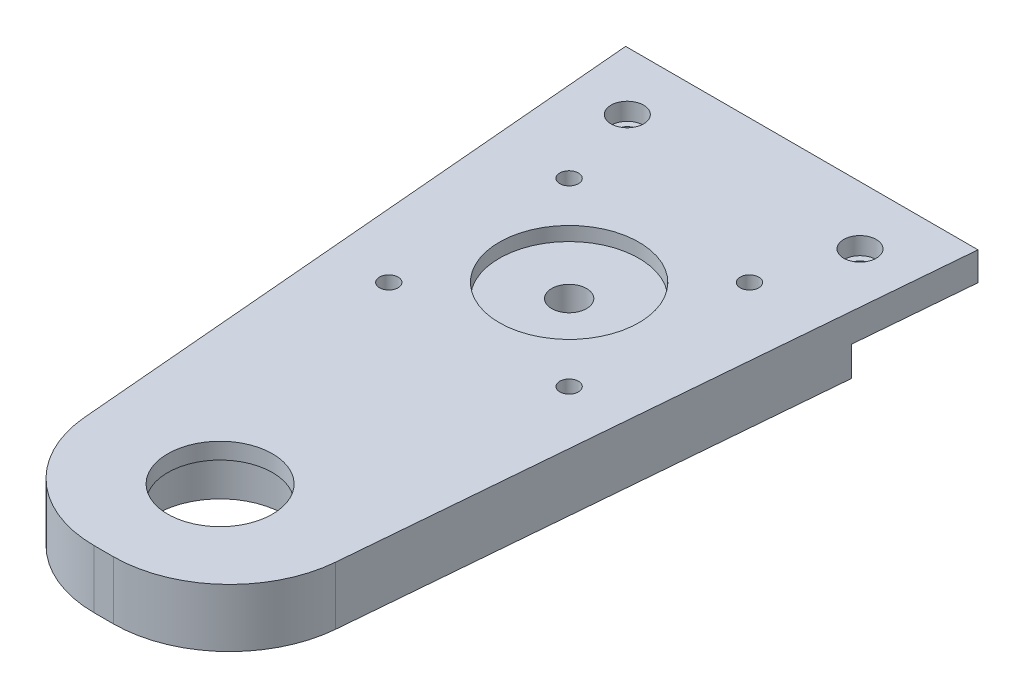
ISO-10303-21;
HEADER;
FILE_DESCRIPTION(('STEP AP214'),'2;1');
FILE_NAME('part.step','',(''),(''),'','','');
FILE_SCHEMA(('AUTOMOTIVE_DESIGN { 1 0 10303 214 1 1 1 1 }'));
ENDSEC;
DATA;
#1=APPLICATION_CONTEXT('core data for automotive mechanical design processes');
#2=APPLICATION_PROTOCOL_DEFINITION('international standard','automotive_design',2000,#1);
#3=PRODUCT_CONTEXT('',#1,'mechanical');
#4=PRODUCT('Part','Part','',(#3));
#5=PRODUCT_RELATED_PRODUCT_CATEGORY('part','',(#4));
#6=PRODUCT_DEFINITION_FORMATION('','',#4);
#7=PRODUCT_DEFINITION_CONTEXT('part definition',#1,'design');
#8=PRODUCT_DEFINITION('design','',#6,#7);
#9=PRODUCT_DEFINITION_SHAPE('','',#8);
#10=(LENGTH_UNIT() NAMED_UNIT(*) SI_UNIT(.MILLI.,.METRE.));
#11=(NAMED_UNIT(*) PLANE_ANGLE_UNIT() SI_UNIT($,.RADIAN.));
#12=(NAMED_UNIT(*) SI_UNIT($,.STERADIAN.) SOLID_ANGLE_UNIT());
#13=UNCERTAINTY_MEASURE_WITH_UNIT(LENGTH_MEASURE(1.E-05),#10,'distance_accuracy_value','');
#14=(GEOMETRIC_REPRESENTATION_CONTEXT(3) GLOBAL_UNCERTAINTY_ASSIGNED_CONTEXT((#13)) GLOBAL_UNIT_ASSIGNED_CONTEXT((#10,
#11,#12)) REPRESENTATION_CONTEXT('',''));
#15=CARTESIAN_POINT('',(0.,0.,0.));
#16=DIRECTION('',(0.,0.,1.));
#17=DIRECTION('',(1.,0.,0.));
#18=AXIS2_PLACEMENT_3D('',#15,#16,#17);
#19=CARTESIAN_POINT('',(-20.,10.2,240.));
#20=DIRECTION('',(0.,-1.,0.));
#21=DIRECTION('',(0.,0.,-1.));
#22=AXIS2_PLACEMENT_3D('',#19,#20,#21);
#23=CYLINDRICAL_SURFACE('',#22,1.69999999999998);
#24=CARTESIAN_POINT('',(-20.,5.1,240.));
#25=DIRECTION('',(0.,-1.,0.));
#26=DIRECTION('',(0.,0.,1.));
#27=AXIS2_PLACEMENT_3D('',#24,#25,#26);
#28=CIRCLE('',#27,1.69999999999998);
#29=CARTESIAN_POINT('',(-20.,5.1,241.7));
#30=VERTEX_POINT('',#29);
#31=EDGE_CURVE('E359',#30,#30,#28,.T.);
#32=ORIENTED_EDGE('',*,*,#31,.T.);
#33=EDGE_LOOP('',(#32));
#34=FACE_BOUND('',#33,.T.);
#35=CARTESIAN_POINT('',(-20.,7.,240.));
#36=DIRECTION('',(0.,1.,0.));
#37=DIRECTION('',(0.,0.,1.));
#38=AXIS2_PLACEMENT_3D('',#35,#36,#37);
#39=CIRCLE('',#38,1.69999999999998);
#40=CARTESIAN_POINT('',(-20.,7.,241.7));
#41=VERTEX_POINT('',#40);
#42=EDGE_CURVE('E183',#41,#41,#39,.F.);
#43=ORIENTED_EDGE('',*,*,#42,.F.);
#44=EDGE_LOOP('',(#43));
#45=FACE_BOUND('',#44,.T.);
#46=ADVANCED_FACE('F39',(#34,#45),#23,.F.);
#47=CARTESIAN_POINT('',(20.,10.2,240.));
#48=DIRECTION('',(0.,-1.,0.));
#49=DIRECTION('',(0.,0.,-1.));
#50=AXIS2_PLACEMENT_3D('',#47,#48,#49);
#51=CYLINDRICAL_SURFACE('',#50,1.7);
#52=CARTESIAN_POINT('',(20.,5.1,240.));
#53=DIRECTION('',(0.,-1.,0.));
#54=DIRECTION('',(0.,0.,-1.));
#55=AXIS2_PLACEMENT_3D('',#52,#53,#54);
#56=CIRCLE('',#55,1.7);
#57=CARTESIAN_POINT('',(20.,5.1,238.3));
#58=VERTEX_POINT('',#57);
#59=EDGE_CURVE('E136',#58,#58,#56,.T.);
#60=ORIENTED_EDGE('',*,*,#59,.T.);
#61=EDGE_LOOP('',(#60));
#62=FACE_BOUND('',#61,.T.);
#63=CARTESIAN_POINT('',(20.,7.,240.));
#64=DIRECTION('',(0.,1.,0.));
#65=DIRECTION('',(0.,0.,1.));
#66=AXIS2_PLACEMENT_3D('',#63,#64,#65);
#67=CIRCLE('',#66,1.7);
#68=CARTESIAN_POINT('',(20.,7.,241.7));
#69=VERTEX_POINT('',#68);
#70=EDGE_CURVE('E180',#69,#69,#67,.F.);
#71=ORIENTED_EDGE('',*,*,#70,.F.);
#72=EDGE_LOOP('',(#71));
#73=FACE_BOUND('',#72,.T.);
#74=ADVANCED_FACE('F231',(#62,#73),#51,.F.);
#75=CARTESIAN_POINT('',(0.,11.,270.));
#76=DIRECTION('',(0.,-1.,0.));
#77=DIRECTION('',(0.,0.,-1.));
#78=AXIS2_PLACEMENT_3D('',#75,#76,#77);
#79=CYLINDRICAL_SURFACE('',#78,3.);
#80=CARTESIAN_POINT('',(0.,0.,270.));
#81=DIRECTION('',(0.,-1.,0.));
#82=DIRECTION('',(0.,0.,-1.));
#83=AXIS2_PLACEMENT_3D('',#80,#81,#82);
#84=CIRCLE('',#83,3.);
#85=CARTESIAN_POINT('',(0.,0.,267.));
#86=VERTEX_POINT('',#85);
#87=EDGE_CURVE('E372',#86,#86,#84,.T.);
#88=ORIENTED_EDGE('',*,*,#87,.T.);
#89=EDGE_LOOP('',(#88));
#90=FACE_BOUND('',#89,.T.);
#91=CARTESIAN_POINT('',(0.,7.6,270.));
#92=DIRECTION('',(0.,1.,0.));
#93=DIRECTION('',(0.,0.,1.));
#94=AXIS2_PLACEMENT_3D('',#91,#92,#93);
#95=CIRCLE('',#94,3.);
#96=CARTESIAN_POINT('',(0.,7.6,273.));
#97=VERTEX_POINT('',#96);
#98=EDGE_CURVE('E175',#97,#97,#95,.F.);
#99=ORIENTED_EDGE('',*,*,#98,.F.);
#100=EDGE_LOOP('',(#99));
#101=FACE_BOUND('',#100,.T.);
#102=ADVANCED_FACE('F238',(#90,#101),#79,.F.);
#103=CARTESIAN_POINT('',(15.5000000000001,-2.,254.5));
#104=DIRECTION('',(0.,1.,0.));
#105=DIRECTION('',(0.,0.,1.));
#106=AXIS2_PLACEMENT_3D('',#103,#104,#105);
#107=CYLINDRICAL_SURFACE('',#106,1.6);
#108=CARTESIAN_POINT('',(15.5000000000001,10.,254.5));
#109=DIRECTION('',(0.,1.,0.));
#110=DIRECTION('',(0.,0.,1.));
#111=AXIS2_PLACEMENT_3D('',#108,#109,#110);
#112=CIRCLE('',#111,1.6);
#113=CARTESIAN_POINT('',(15.5000000000001,10.,256.1));
#114=VERTEX_POINT('',#113);
#115=EDGE_CURVE('E375',#114,#114,#112,.T.);
#116=ORIENTED_EDGE('',*,*,#115,.T.);
#117=EDGE_LOOP('',(#116));
#118=FACE_BOUND('',#117,.T.);
#119=CARTESIAN_POINT('',(15.5000000000001,3.5,254.5));
#120=DIRECTION('',(0.,-1.,0.));
#121=DIRECTION('',(0.,0.,-1.));
#122=AXIS2_PLACEMENT_3D('',#119,#120,#121);
#123=CIRCLE('',#122,1.6);
#124=CARTESIAN_POINT('',(15.5000000000001,3.5,252.9));
#125=VERTEX_POINT('',#124);
#126=EDGE_CURVE('E171',#125,#125,#123,.F.);
#127=ORIENTED_EDGE('',*,*,#126,.F.);
#128=EDGE_LOOP('',(#127));
#129=FACE_BOUND('',#128,.T.);
#130=ADVANCED_FACE('F326',(#118,#129),#107,.F.);
#131=CARTESIAN_POINT('',(-15.5,-2.,254.5));
#132=DIRECTION('',(0.,1.,0.));
#133=DIRECTION('',(0.,0.,1.));
#134=AXIS2_PLACEMENT_3D('',#131,#132,#133);
#135=CYLINDRICAL_SURFACE('',#134,1.6);
#136=CARTESIAN_POINT('',(-15.5,10.,254.5));
#137=DIRECTION('',(0.,1.,0.));
#138=DIRECTION('',(0.,0.,1.));
#139=AXIS2_PLACEMENT_3D('',#136,#137,#138);
#140=CIRCLE('',#139,1.6);
#141=CARTESIAN_POINT('',(-15.5,10.,256.1));
#142=VERTEX_POINT('',#141);
#143=EDGE_CURVE('E378',#142,#142,#140,.T.);
#144=ORIENTED_EDGE('',*,*,#143,.T.);
#145=EDGE_LOOP('',(#144));
#146=FACE_BOUND('',#145,.T.);
#147=CARTESIAN_POINT('',(-15.5,3.5,254.5));
#148=DIRECTION('',(0.,-1.,0.));
#149=DIRECTION('',(0.,0.,-1.));
#150=AXIS2_PLACEMENT_3D('',#147,#148,#149);
#151=CIRCLE('',#150,1.6);
#152=CARTESIAN_POINT('',(-15.5,3.5,252.9));
#153=VERTEX_POINT('',#152);
#154=EDGE_CURVE('E167',#153,#153,#151,.F.);
#155=ORIENTED_EDGE('',*,*,#154,.F.);
#156=EDGE_LOOP('',(#155));
#157=FACE_BOUND('',#156,.T.);
#158=ADVANCED_FACE('F322',(#146,#157),#135,.F.);
#159=CARTESIAN_POINT('',(-15.4999999999997,-2.,285.5));
#160=DIRECTION('',(0.,1.,0.));
#161=DIRECTION('',(0.,0.,1.));
#162=AXIS2_PLACEMENT_3D('',#159,#160,#161);
#163=CYLINDRICAL_SURFACE('',#162,1.6);
#164=CARTESIAN_POINT('',(-15.4999999999997,10.,285.5));
#165=DIRECTION('',(0.,1.,0.));
#166=DIRECTION('',(0.,0.,1.));
#167=AXIS2_PLACEMENT_3D('',#164,#165,#166);
#168=CIRCLE('',#167,1.6);
#169=CARTESIAN_POINT('',(-15.4999999999997,10.,287.1));
#170=VERTEX_POINT('',#169);
#171=EDGE_CURVE('E381',#170,#170,#168,.T.);
#172=ORIENTED_EDGE('',*,*,#171,.T.);
#173=EDGE_LOOP('',(#172));
#174=FACE_BOUND('',#173,.T.);
#175=CARTESIAN_POINT('',(-15.4999999999997,3.5,285.5));
#176=DIRECTION('',(0.,-1.,0.));
#177=DIRECTION('',(0.,0.,-1.));
#178=AXIS2_PLACEMENT_3D('',#175,#176,#177);
#179=CIRCLE('',#178,1.59999999999999);
#180=CARTESIAN_POINT('',(-15.4999999999997,3.5,283.9));
#181=VERTEX_POINT('',#180);
#182=EDGE_CURVE('E389',#181,#181,#179,.T.);
#183=ORIENTED_EDGE('',*,*,#182,.T.);
#184=EDGE_LOOP('',(#183));
#185=FACE_BOUND('',#184,.T.);
#186=ADVANCED_FACE('F325',(#174,#185),#163,.F.);
#187=CARTESIAN_POINT('',(15.5000000000003,-2.,285.5));
#188=DIRECTION('',(0.,1.,0.));
#189=DIRECTION('',(0.,0.,1.));
#190=AXIS2_PLACEMENT_3D('',#187,#188,#189);
#191=CYLINDRICAL_SURFACE('',#190,1.6);
#192=CARTESIAN_POINT('',(15.5000000000003,10.,285.5));
#193=DIRECTION('',(0.,1.,0.));
#194=DIRECTION('',(0.,0.,1.));
#195=AXIS2_PLACEMENT_3D('',#192,#193,#194);
#196=CIRCLE('',#195,1.6);
#197=CARTESIAN_POINT('',(15.5000000000003,10.,287.1));
#198=VERTEX_POINT('',#197);
#199=EDGE_CURVE('E174',#198,#198,#196,.T.);
#200=ORIENTED_EDGE('',*,*,#199,.T.);
#201=EDGE_LOOP('',(#200));
#202=FACE_BOUND('',#201,.T.);
#203=CARTESIAN_POINT('',(15.5000000000003,3.5,285.5));
#204=DIRECTION('',(0.,-1.,0.));
#205=DIRECTION('',(0.,0.,-1.));
#206=AXIS2_PLACEMENT_3D('',#203,#204,#205);
#207=CIRCLE('',#206,1.6);
#208=CARTESIAN_POINT('',(15.5000000000003,3.5,283.9));
#209=VERTEX_POINT('',#208);
#210=EDGE_CURVE('E164',#209,#209,#207,.F.);
#211=ORIENTED_EDGE('',*,*,#210,.F.);
#212=EDGE_LOOP('',(#211));
#213=FACE_BOUND('',#212,.T.);
#214=ADVANCED_FACE('F330',(#202,#213),#191,.F.);
#215=CARTESIAN_POINT('',(0.,0.,0.));
#216=DIRECTION('',(0.,-1.,0.));
#217=DIRECTION('',(0.,0.,-1.));
#218=AXIS2_PLACEMENT_3D('',#215,#216,#217);
#219=PLANE('',#218);
#220=CARTESIAN_POINT('',(-15.4999999999996,0.,254.5));
#221=DIRECTION('',(0.,-1.,0.));
#222=DIRECTION('',(0.,0.,-1.));
#223=AXIS2_PLACEMENT_3D('',#220,#221,#222);
#224=CIRCLE('',#223,2.89999999999996);
#225=CARTESIAN_POINT('',(-15.4999999999996,0.,251.6));
#226=VERTEX_POINT('',#225);
#227=EDGE_CURVE('E397',#226,#226,#224,.T.);
#228=ORIENTED_EDGE('',*,*,#227,.F.);
#229=EDGE_LOOP('',(#228));
#230=FACE_BOUND('',#229,.T.);
#231=CARTESIAN_POINT('',(15.5000000000001,0.,254.5));
#232=DIRECTION('',(0.,-1.,0.));
#233=DIRECTION('',(0.,0.,-1.));
#234=AXIS2_PLACEMENT_3D('',#231,#232,#233);
#235=CIRCLE('',#234,2.89999999999999);
#236=CARTESIAN_POINT('',(15.5000000000001,0.,251.6));
#237=VERTEX_POINT('',#236);
#238=EDGE_CURVE('E403',#237,#237,#235,.T.);
#239=ORIENTED_EDGE('',*,*,#238,.F.);
#240=EDGE_LOOP('',(#239));
#241=FACE_BOUND('',#240,.T.);
#242=CARTESIAN_POINT('',(15.4999999999999,0.,285.5));
#243=DIRECTION('',(0.,-1.,0.));
#244=DIRECTION('',(0.,0.,-1.));
#245=AXIS2_PLACEMENT_3D('',#242,#243,#244);
#246=CIRCLE('',#245,2.90000000000001);
#247=CARTESIAN_POINT('',(15.4999999999999,0.,282.6));
#248=VERTEX_POINT('',#247);
#249=EDGE_CURVE('E394',#248,#248,#246,.T.);
#250=ORIENTED_EDGE('',*,*,#249,.F.);
#251=EDGE_LOOP('',(#250));
#252=FACE_BOUND('',#251,.T.);
#253=CARTESIAN_POINT('',(-15.4999999999997,0.,285.5));
#254=DIRECTION('',(0.,-1.,0.));
#255=DIRECTION('',(0.,0.,-1.));
#256=AXIS2_PLACEMENT_3D('',#253,#254,#255);
#257=CIRCLE('',#256,2.89999999999999);
#258=CARTESIAN_POINT('',(-15.4999999999997,0.,282.6));
#259=VERTEX_POINT('',#258);
#260=EDGE_CURVE('E386',#259,#259,#257,.T.);
#261=ORIENTED_EDGE('',*,*,#260,.F.);
#262=EDGE_LOOP('',(#261));
#263=FACE_BOUND('',#262,.T.);
#264=ORIENTED_EDGE('',*,*,#87,.F.);
#265=EDGE_LOOP('',(#264));
#266=FACE_BOUND('',#265,.T.);
#267=CARTESIAN_POINT('',(0.,0.,330.));
#268=DIRECTION('',(0.,-1.,0.));
#269=DIRECTION('',(0.,0.,-1.));
#270=AXIS2_PLACEMENT_3D('',#267,#268,#269);
#271=CIRCLE('',#270,11.);
#272=CARTESIAN_POINT('',(0.,0.,319.));
#273=VERTEX_POINT('',#272);
#274=EDGE_CURVE('E162',#273,#273,#271,.T.);
#275=ORIENTED_EDGE('',*,*,#274,.F.);
#276=EDGE_LOOP('',(#275));
#277=FACE_BOUND('',#276,.T.);
#278=DIRECTION('',(1.,0.,0.));
#279=VECTOR('',#278,1.);
#280=CARTESIAN_POINT('',(0.,0.,350.));
#281=LINE('',#280,#279);
#282=CARTESIAN_POINT('',(-1.64095077685681,0.,350.));
#283=VERTEX_POINT('',#282);
#284=CARTESIAN_POINT('',(1.64095077685684,0.,350.));
#285=VERTEX_POINT('',#284);
#286=EDGE_CURVE('E146',#283,#285,#281,.T.);
#287=ORIENTED_EDGE('',*,*,#286,.F.);
#288=CARTESIAN_POINT('',(-1.64095077685681,0.,330.));
#289=DIRECTION('',(0.,-1.,0.));
#290=DIRECTION('',(0.,0.,-1.));
#291=AXIS2_PLACEMENT_3D('',#288,#289,#290);
#292=CIRCLE('',#291,20.);
#293=CARTESIAN_POINT('',(-21.5678837576918,0.,331.708022826929));
#294=VERTEX_POINT('',#293);
#295=EDGE_CURVE('E194',#283,#294,#292,.T.);
#296=ORIENTED_EDGE('',*,*,#295,.T.);
#297=DIRECTION('',(0.0854011413464358,0.,0.996346649041751));
#298=VECTOR('',#297,1.);
#299=CARTESIAN_POINT('',(-49.6353322528363,0.,4.25445705024311));
#300=LINE('',#299,#298);
#301=CARTESIAN_POINT('',(-28.5714285714286,0.,250.));
#302=VERTEX_POINT('',#301);
#303=EDGE_CURVE('E147',#302,#294,#300,.T.);
#304=ORIENTED_EDGE('',*,*,#303,.F.);
#305=DIRECTION('',(1.,0.,0.));
#306=VECTOR('',#305,1.);
#307=CARTESIAN_POINT('',(0.,0.,250.));
#308=LINE('',#307,#306);
#309=CARTESIAN_POINT('',(28.5714285714286,0.,250.));
#310=VERTEX_POINT('',#309);
#311=EDGE_CURVE('E113',#302,#310,#308,.T.);
#312=ORIENTED_EDGE('',*,*,#311,.T.);
#313=DIRECTION('',(-0.0854011413464357,0.,0.996346649041751));
#314=VECTOR('',#313,1.);
#315=CARTESIAN_POINT('',(49.6353322528363,0.,4.25445705024311));
#316=LINE('',#315,#314);
#317=CARTESIAN_POINT('',(21.5678837576919,0.,331.708022826929));
#318=VERTEX_POINT('',#317);
#319=EDGE_CURVE('E143',#310,#318,#316,.T.);
#320=ORIENTED_EDGE('',*,*,#319,.T.);
#321=CARTESIAN_POINT('',(1.64095077685684,0.,330.));
#322=DIRECTION('',(0.,-1.,0.));
#323=DIRECTION('',(0.,0.,-1.));
#324=AXIS2_PLACEMENT_3D('',#321,#322,#323);
#325=CIRCLE('',#324,20.);
#326=EDGE_CURVE('E192',#318,#285,#325,.T.);
#327=ORIENTED_EDGE('',*,*,#326,.T.);
#328=EDGE_LOOP('',(#287,#296,#304,#312,#320,#327));
#329=FACE_BOUND('',#328,.T.);
#330=ADVANCED_FACE('F209',(#230,#241,#252,#263,#266,#277,#329),#219,.T.);
#331=CARTESIAN_POINT('',(49.6353322528363,10.,4.25445705024311));
#332=DIRECTION('',(0.996346649041751,0.,0.0854011413464357));
#333=DIRECTION('',(0.0854011413464357,0.,-0.996346649041751));
#334=AXIS2_PLACEMENT_3D('',#331,#332,#333);
#335=PLANE('',#334);
#336=DIRECTION('',(-0.0854011413464357,0.,0.996346649041751));
#337=VECTOR('',#336,1.);
#338=CARTESIAN_POINT('',(49.6353322528363,10.,4.25445705024311));
#339=LINE('',#338,#337);
#340=CARTESIAN_POINT('',(30.2857142857143,10.,230.));
#341=VERTEX_POINT('',#340);
#342=CARTESIAN_POINT('',(21.5678837576919,10.,331.708022826929));
#343=VERTEX_POINT('',#342);
#344=EDGE_CURVE('E149',#341,#343,#339,.T.);
#345=ORIENTED_EDGE('',*,*,#344,.T.);
#346=DIRECTION('',(0.,-1.,0.));
#347=VECTOR('',#346,1.);
#348=CARTESIAN_POINT('',(21.5678837576919,0.,331.708022826929));
#349=LINE('',#348,#347);
#350=EDGE_CURVE('E11',#343,#318,#349,.T.);
#351=ORIENTED_EDGE('',*,*,#350,.T.);
#352=ORIENTED_EDGE('',*,*,#319,.F.);
#353=DIRECTION('',(0.,-1.,0.));
#354=VECTOR('',#353,1.);
#355=CARTESIAN_POINT('',(28.5714285714286,5.1,250.));
#356=LINE('',#355,#354);
#357=CARTESIAN_POINT('',(28.5714285714286,5.1,250.));
#358=VERTEX_POINT('',#357);
#359=EDGE_CURVE('E116',#358,#310,#356,.T.);
#360=ORIENTED_EDGE('',*,*,#359,.F.);
#361=DIRECTION('',(-0.0854011413464357,0.,0.996346649041751));
#362=VECTOR('',#361,1.);
#363=CARTESIAN_POINT('',(49.6353322528363,5.1,4.25445705024311));
#364=LINE('',#363,#362);
#365=CARTESIAN_POINT('',(30.2857142857143,5.1,230.));
#366=VERTEX_POINT('',#365);
#367=EDGE_CURVE('E117',#366,#358,#364,.T.);
#368=ORIENTED_EDGE('',*,*,#367,.F.);
#369=DIRECTION('',(0.,1.,0.));
#370=VECTOR('',#369,1.);
#371=CARTESIAN_POINT('',(30.2857142857143,10.,230.));
#372=LINE('',#371,#370);
#373=EDGE_CURVE('E141',#366,#341,#372,.T.);
#374=ORIENTED_EDGE('',*,*,#373,.T.);
#375=EDGE_LOOP('',(#345,#351,#352,#360,#368,#374));
#376=FACE_BOUND('',#375,.T.);
#377=ADVANCED_FACE('F214',(#376),#335,.T.);
#378=CARTESIAN_POINT('',(-49.6353322528363,10.,4.25445705024311));
#379=DIRECTION('',(0.996346649041751,0.,-0.0854011413464358));
#380=DIRECTION('',(-0.0854011413464358,0.,-0.996346649041751));
#381=AXIS2_PLACEMENT_3D('',#378,#379,#380);
#382=PLANE('',#381);
#383=ORIENTED_EDGE('',*,*,#303,.T.);
#384=DIRECTION('',(0.,-1.,0.));
#385=VECTOR('',#384,1.);
#386=CARTESIAN_POINT('',(-21.5678837576918,10.,331.708022826929));
#387=LINE('',#386,#385);
#388=CARTESIAN_POINT('',(-21.5678837576918,10.,331.708022826929));
#389=VERTEX_POINT('',#388);
#390=EDGE_CURVE('E62',#294,#389,#387,.F.);
#391=ORIENTED_EDGE('',*,*,#390,.T.);
#392=DIRECTION('',(0.0854011413464358,0.,0.996346649041751));
#393=VECTOR('',#392,1.);
#394=CARTESIAN_POINT('',(-49.6353322528363,10.,4.25445705024311));
#395=LINE('',#394,#393);
#396=CARTESIAN_POINT('',(-30.2857142857143,10.,230.));
#397=VERTEX_POINT('',#396);
#398=EDGE_CURVE('E144',#397,#389,#395,.T.);
#399=ORIENTED_EDGE('',*,*,#398,.F.);
#400=DIRECTION('',(0.,1.,0.));
#401=VECTOR('',#400,1.);
#402=CARTESIAN_POINT('',(-30.2857142857143,10.,230.));
#403=LINE('',#402,#401);
#404=CARTESIAN_POINT('',(-30.2857142857143,5.1,230.));
#405=VERTEX_POINT('',#404);
#406=EDGE_CURVE('E128',#405,#397,#403,.T.);
#407=ORIENTED_EDGE('',*,*,#406,.F.);
#408=DIRECTION('',(-0.0854011413464358,0.,-0.996346649041751));
#409=VECTOR('',#408,1.);
#410=CARTESIAN_POINT('',(-49.6353322528363,5.1,4.25445705024311));
#411=LINE('',#410,#409);
#412=CARTESIAN_POINT('',(-28.5714285714286,5.1,250.));
#413=VERTEX_POINT('',#412);
#414=EDGE_CURVE('E121',#413,#405,#411,.T.);
#415=ORIENTED_EDGE('',*,*,#414,.F.);
#416=DIRECTION('',(0.,-1.,0.));
#417=VECTOR('',#416,1.);
#418=CARTESIAN_POINT('',(-28.5714285714286,5.1,250.));
#419=LINE('',#418,#417);
#420=EDGE_CURVE('E107',#413,#302,#419,.T.);
#421=ORIENTED_EDGE('',*,*,#420,.T.);
#422=EDGE_LOOP('',(#383,#391,#399,#407,#415,#421));
#423=FACE_BOUND('',#422,.T.);
#424=ADVANCED_FACE('F127',(#423),#382,.F.);
#425=CARTESIAN_POINT('',(0.,10.,230.));
#426=DIRECTION('',(0.,0.,-1.));
#427=DIRECTION('',(-1.,0.,0.));
#428=AXIS2_PLACEMENT_3D('',#425,#426,#427);
#429=PLANE('',#428);
#430=ORIENTED_EDGE('',*,*,#373,.F.);
#431=DIRECTION('',(1.,0.,0.));
#432=VECTOR('',#431,1.);
#433=CARTESIAN_POINT('',(0.,5.1,230.));
#434=LINE('',#433,#432);
#435=EDGE_CURVE('E129',#405,#366,#434,.T.);
#436=ORIENTED_EDGE('',*,*,#435,.F.);
#437=ORIENTED_EDGE('',*,*,#406,.T.);
#438=DIRECTION('',(1.,0.,0.));
#439=VECTOR('',#438,1.);
#440=CARTESIAN_POINT('',(0.,10.,230.));
#441=LINE('',#440,#439);
#442=EDGE_CURVE('E137',#397,#341,#441,.T.);
#443=ORIENTED_EDGE('',*,*,#442,.T.);
#444=EDGE_LOOP('',(#430,#436,#437,#443));
#445=FACE_BOUND('',#444,.T.);
#446=ADVANCED_FACE('F217',(#445),#429,.T.);
#447=CARTESIAN_POINT('',(0.,10.,0.));
#448=DIRECTION('',(0.,-1.,0.));
#449=DIRECTION('',(0.,0.,-1.));
#450=AXIS2_PLACEMENT_3D('',#447,#448,#449);
#451=PLANE('',#450);
#452=CARTESIAN_POINT('',(-20.,10.,240.));
#453=DIRECTION('',(0.,1.,0.));
#454=DIRECTION('',(0.,0.,1.));
#455=AXIS2_PLACEMENT_3D('',#452,#453,#454);
#456=CIRCLE('',#455,2.8);
#457=CARTESIAN_POINT('',(-20.,10.,242.8));
#458=VERTEX_POINT('',#457);
#459=EDGE_CURVE('E421',#458,#458,#456,.T.);
#460=ORIENTED_EDGE('',*,*,#459,.F.);
#461=EDGE_LOOP('',(#460));
#462=FACE_BOUND('',#461,.T.);
#463=CARTESIAN_POINT('',(20.,10.,240.));
#464=DIRECTION('',(0.,1.,0.));
#465=DIRECTION('',(0.,0.,1.));
#466=AXIS2_PLACEMENT_3D('',#463,#464,#465);
#467=CIRCLE('',#466,2.8);
#468=CARTESIAN_POINT('',(20.,10.,242.8));
#469=VERTEX_POINT('',#468);
#470=EDGE_CURVE('E418',#469,#469,#467,.T.);
#471=ORIENTED_EDGE('',*,*,#470,.F.);
#472=EDGE_LOOP('',(#471));
#473=FACE_BOUND('',#472,.T.);
#474=CARTESIAN_POINT('',(0.,10.,270.));
#475=DIRECTION('',(0.,1.,0.));
#476=DIRECTION('',(0.,0.,1.));
#477=AXIS2_PLACEMENT_3D('',#474,#475,#476);
#478=CIRCLE('',#477,12.);
#479=CARTESIAN_POINT('',(0.,10.,282.));
#480=VERTEX_POINT('',#479);
#481=EDGE_CURVE('E187',#480,#480,#478,.T.);
#482=ORIENTED_EDGE('',*,*,#481,.F.);
#483=EDGE_LOOP('',(#482));
#484=FACE_BOUND('',#483,.T.);
#485=ORIENTED_EDGE('',*,*,#199,.F.);
#486=EDGE_LOOP('',(#485));
#487=FACE_BOUND('',#486,.T.);
#488=ORIENTED_EDGE('',*,*,#171,.F.);
#489=EDGE_LOOP('',(#488));
#490=FACE_BOUND('',#489,.T.);
#491=ORIENTED_EDGE('',*,*,#143,.F.);
#492=EDGE_LOOP('',(#491));
#493=FACE_BOUND('',#492,.T.);
#494=ORIENTED_EDGE('',*,*,#115,.F.);
#495=EDGE_LOOP('',(#494));
#496=FACE_BOUND('',#495,.T.);
#497=CARTESIAN_POINT('',(0.,10.,330.));
#498=DIRECTION('',(0.,-1.,0.));
#499=DIRECTION('',(0.,0.,-1.));
#500=AXIS2_PLACEMENT_3D('',#497,#498,#499);
#501=CIRCLE('',#500,9.);
#502=CARTESIAN_POINT('',(0.,10.,321.));
#503=VERTEX_POINT('',#502);
#504=EDGE_CURVE('E159',#503,#503,#501,.T.);
#505=ORIENTED_EDGE('',*,*,#504,.T.);
#506=EDGE_LOOP('',(#505));
#507=FACE_BOUND('',#506,.T.);
#508=ORIENTED_EDGE('',*,*,#398,.T.);
#509=CARTESIAN_POINT('',(-1.64095077685681,10.,330.));
#510=DIRECTION('',(0.,-1.,0.));
#511=DIRECTION('',(0.,0.,-1.));
#512=AXIS2_PLACEMENT_3D('',#509,#510,#511);
#513=CIRCLE('',#512,20.);
#514=CARTESIAN_POINT('',(-1.64095077685681,10.,350.));
#515=VERTEX_POINT('',#514);
#516=EDGE_CURVE('E47',#389,#515,#513,.F.);
#517=ORIENTED_EDGE('',*,*,#516,.T.);
#518=DIRECTION('',(1.,0.,0.));
#519=VECTOR('',#518,1.);
#520=CARTESIAN_POINT('',(0.,10.,350.));
#521=LINE('',#520,#519);
#522=CARTESIAN_POINT('',(1.64095077685684,10.,350.));
#523=VERTEX_POINT('',#522);
#524=EDGE_CURVE('E153',#515,#523,#521,.T.);
#525=ORIENTED_EDGE('',*,*,#524,.T.);
#526=CARTESIAN_POINT('',(1.64095077685684,10.,330.));
#527=DIRECTION('',(0.,-1.,0.));
#528=DIRECTION('',(0.,0.,-1.));
#529=AXIS2_PLACEMENT_3D('',#526,#527,#528);
#530=CIRCLE('',#529,20.);
#531=EDGE_CURVE('E54',#523,#343,#530,.F.);
#532=ORIENTED_EDGE('',*,*,#531,.T.);
#533=ORIENTED_EDGE('',*,*,#344,.F.);
#534=ORIENTED_EDGE('',*,*,#442,.F.);
#535=EDGE_LOOP('',(#508,#517,#525,#532,#533,#534));
#536=FACE_BOUND('',#535,.T.);
#537=ADVANCED_FACE('F199',(#462,#473,#484,#487,#490,#493,#496,#507,#536),#451,.F.);
#538=CARTESIAN_POINT('',(0.,10.,350.));
#539=DIRECTION('',(0.,0.,-1.));
#540=DIRECTION('',(-1.,0.,0.));
#541=AXIS2_PLACEMENT_3D('',#538,#539,#540);
#542=PLANE('',#541);
#543=ORIENTED_EDGE('',*,*,#524,.F.);
#544=DIRECTION('',(0.,-1.,0.));
#545=VECTOR('',#544,1.);
#546=CARTESIAN_POINT('',(-1.64095077685681,10.,350.));
#547=LINE('',#546,#545);
#548=EDGE_CURVE('E189',#515,#283,#547,.T.);
#549=ORIENTED_EDGE('',*,*,#548,.T.);
#550=ORIENTED_EDGE('',*,*,#286,.T.);
#551=DIRECTION('',(0.,-1.,0.));
#552=VECTOR('',#551,1.);
#553=CARTESIAN_POINT('',(1.64095077685684,10.,350.));
#554=LINE('',#553,#552);
#555=EDGE_CURVE('E158',#285,#523,#554,.F.);
#556=ORIENTED_EDGE('',*,*,#555,.T.);
#557=EDGE_LOOP('',(#543,#549,#550,#556));
#558=FACE_BOUND('',#557,.T.);
#559=ADVANCED_FACE('F204',(#558),#542,.F.);
#560=CARTESIAN_POINT('',(0.,5.1,250.));
#561=DIRECTION('',(0.,0.,-1.));
#562=DIRECTION('',(-1.,0.,0.));
#563=AXIS2_PLACEMENT_3D('',#560,#561,#562);
#564=PLANE('',#563);
#565=ORIENTED_EDGE('',*,*,#311,.F.);
#566=ORIENTED_EDGE('',*,*,#420,.F.);
#567=DIRECTION('',(1.,0.,0.));
#568=VECTOR('',#567,1.);
#569=CARTESIAN_POINT('',(0.,5.1,250.));
#570=LINE('',#569,#568);
#571=EDGE_CURVE('E110',#413,#358,#570,.T.);
#572=ORIENTED_EDGE('',*,*,#571,.T.);
#573=ORIENTED_EDGE('',*,*,#359,.T.);
#574=EDGE_LOOP('',(#565,#566,#572,#573));
#575=FACE_BOUND('',#574,.T.);
#576=ADVANCED_FACE('F109',(#575),#564,.T.);
#577=CARTESIAN_POINT('',(0.,5.1,0.));
#578=DIRECTION('',(0.,-1.,0.));
#579=DIRECTION('',(0.,0.,-1.));
#580=AXIS2_PLACEMENT_3D('',#577,#578,#579);
#581=PLANE('',#580);
#582=ORIENTED_EDGE('',*,*,#59,.F.);
#583=EDGE_LOOP('',(#582));
#584=FACE_BOUND('',#583,.T.);
#585=ORIENTED_EDGE('',*,*,#31,.F.);
#586=EDGE_LOOP('',(#585));
#587=FACE_BOUND('',#586,.T.);
#588=ORIENTED_EDGE('',*,*,#571,.F.);
#589=ORIENTED_EDGE('',*,*,#414,.T.);
#590=ORIENTED_EDGE('',*,*,#435,.T.);
#591=ORIENTED_EDGE('',*,*,#367,.T.);
#592=EDGE_LOOP('',(#588,#589,#590,#591));
#593=FACE_BOUND('',#592,.T.);
#594=ADVANCED_FACE('F120',(#584,#587,#593),#581,.T.);
#595=CARTESIAN_POINT('',(0.,7.2,330.));
#596=DIRECTION('',(0.,-1.,0.));
#597=DIRECTION('',(0.,0.,-1.));
#598=AXIS2_PLACEMENT_3D('',#595,#596,#597);
#599=CYLINDRICAL_SURFACE('',#598,11.);
#600=CARTESIAN_POINT('',(0.,7.2,330.));
#601=DIRECTION('',(0.,-1.,0.));
#602=DIRECTION('',(0.,0.,-1.));
#603=AXIS2_PLACEMENT_3D('',#600,#601,#602);
#604=CIRCLE('',#603,11.);
#605=CARTESIAN_POINT('',(0.,7.2,319.));
#606=VERTEX_POINT('',#605);
#607=EDGE_CURVE('E354',#606,#606,#604,.T.);
#608=ORIENTED_EDGE('',*,*,#607,.F.);
#609=EDGE_LOOP('',(#608));
#610=FACE_BOUND('',#609,.T.);
#611=ORIENTED_EDGE('',*,*,#274,.T.);
#612=EDGE_LOOP('',(#611));
#613=FACE_BOUND('',#612,.T.);
#614=ADVANCED_FACE('F246',(#610,#613),#599,.F.);
#615=CARTESIAN_POINT('',(0.,7.2,330.));
#616=DIRECTION('',(0.,-1.,0.));
#617=DIRECTION('',(0.,0.,-1.));
#618=AXIS2_PLACEMENT_3D('',#615,#616,#617);
#619=PLANE('',#618);
#620=CARTESIAN_POINT('',(0.,7.2,330.));
#621=DIRECTION('',(0.,-1.,0.));
#622=DIRECTION('',(0.,0.,-1.));
#623=AXIS2_PLACEMENT_3D('',#620,#621,#622);
#624=CIRCLE('',#623,9.);
#625=CARTESIAN_POINT('',(0.,7.2,321.));
#626=VERTEX_POINT('',#625);
#627=EDGE_CURVE('E163',#626,#626,#624,.T.);
#628=ORIENTED_EDGE('',*,*,#627,.F.);
#629=EDGE_LOOP('',(#628));
#630=FACE_BOUND('',#629,.T.);
#631=ORIENTED_EDGE('',*,*,#607,.T.);
#632=EDGE_LOOP('',(#631));
#633=FACE_BOUND('',#632,.T.);
#634=ADVANCED_FACE('F343',(#630,#633),#619,.T.);
#635=CARTESIAN_POINT('',(0.,14.4,330.));
#636=DIRECTION('',(0.,-1.,0.));
#637=DIRECTION('',(0.,0.,-1.));
#638=AXIS2_PLACEMENT_3D('',#635,#636,#637);
#639=CYLINDRICAL_SURFACE('',#638,9.);
#640=ORIENTED_EDGE('',*,*,#627,.T.);
#641=EDGE_LOOP('',(#640));
#642=FACE_BOUND('',#641,.T.);
#643=ORIENTED_EDGE('',*,*,#504,.F.);
#644=EDGE_LOOP('',(#643));
#645=FACE_BOUND('',#644,.T.);
#646=ADVANCED_FACE('F298',(#642,#645),#639,.F.);
#647=CARTESIAN_POINT('',(15.4999999999999,3.5,285.5));
#648=DIRECTION('',(0.,-1.,0.));
#649=DIRECTION('',(0.,0.,-1.));
#650=AXIS2_PLACEMENT_3D('',#647,#648,#649);
#651=PLANE('',#650);
#652=CARTESIAN_POINT('',(15.4999999999999,3.5,285.5));
#653=DIRECTION('',(0.,-1.,0.));
#654=DIRECTION('',(0.,0.,-1.));
#655=AXIS2_PLACEMENT_3D('',#652,#653,#654);
#656=CIRCLE('',#655,2.90000000000001);
#657=CARTESIAN_POINT('',(15.4999999999999,3.5,282.6));
#658=VERTEX_POINT('',#657);
#659=EDGE_CURVE('E406',#658,#658,#656,.T.);
#660=ORIENTED_EDGE('',*,*,#659,.T.);
#661=EDGE_LOOP('',(#660));
#662=FACE_BOUND('',#661,.T.);
#663=ORIENTED_EDGE('',*,*,#210,.T.);
#664=EDGE_LOOP('',(#663));
#665=FACE_BOUND('',#664,.T.);
#666=ADVANCED_FACE('F294',(#662,#665),#651,.T.);
#667=CARTESIAN_POINT('',(15.4999999999999,3.5,285.5));
#668=DIRECTION('',(0.,-1.,0.));
#669=DIRECTION('',(0.,0.,-1.));
#670=AXIS2_PLACEMENT_3D('',#667,#668,#669);
#671=CYLINDRICAL_SURFACE('',#670,2.90000000000001);
#672=ORIENTED_EDGE('',*,*,#659,.F.);
#673=EDGE_LOOP('',(#672));
#674=FACE_BOUND('',#673,.T.);
#675=ORIENTED_EDGE('',*,*,#249,.T.);
#676=EDGE_LOOP('',(#675));
#677=FACE_BOUND('',#676,.T.);
#678=ADVANCED_FACE('F290',(#674,#677),#671,.F.);
#679=CARTESIAN_POINT('',(-15.4999999999997,3.5,285.5));
#680=DIRECTION('',(0.,-1.,0.));
#681=DIRECTION('',(0.,0.,-1.));
#682=AXIS2_PLACEMENT_3D('',#679,#680,#681);
#683=CYLINDRICAL_SURFACE('',#682,2.89999999999999);
#684=CARTESIAN_POINT('',(-15.4999999999997,3.5,285.5));
#685=DIRECTION('',(0.,-1.,0.));
#686=DIRECTION('',(0.,0.,-1.));
#687=AXIS2_PLACEMENT_3D('',#684,#685,#686);
#688=CIRCLE('',#687,2.89999999999999);
#689=CARTESIAN_POINT('',(-15.4999999999997,3.5,282.6));
#690=VERTEX_POINT('',#689);
#691=EDGE_CURVE('E168',#690,#690,#688,.T.);
#692=ORIENTED_EDGE('',*,*,#691,.F.);
#693=EDGE_LOOP('',(#692));
#694=FACE_BOUND('',#693,.T.);
#695=ORIENTED_EDGE('',*,*,#260,.T.);
#696=EDGE_LOOP('',(#695));
#697=FACE_BOUND('',#696,.T.);
#698=ADVANCED_FACE('F293',(#694,#697),#683,.F.);
#699=CARTESIAN_POINT('',(-15.4999999999997,3.5,285.5));
#700=DIRECTION('',(0.,-1.,0.));
#701=DIRECTION('',(0.,0.,-1.));
#702=AXIS2_PLACEMENT_3D('',#699,#700,#701);
#703=PLANE('',#702);
#704=ORIENTED_EDGE('',*,*,#182,.F.);
#705=EDGE_LOOP('',(#704));
#706=FACE_BOUND('',#705,.T.);
#707=ORIENTED_EDGE('',*,*,#691,.T.);
#708=EDGE_LOOP('',(#707));
#709=FACE_BOUND('',#708,.T.);
#710=ADVANCED_FACE('F314',(#706,#709),#703,.T.);
#711=CARTESIAN_POINT('',(-15.4999999999996,3.5,254.5));
#712=DIRECTION('',(0.,-1.,0.));
#713=DIRECTION('',(0.,0.,-1.));
#714=AXIS2_PLACEMENT_3D('',#711,#712,#713);
#715=PLANE('',#714);
#716=CARTESIAN_POINT('',(-15.4999999999996,3.5,254.5));
#717=DIRECTION('',(0.,-1.,0.));
#718=DIRECTION('',(0.,0.,-1.));
#719=AXIS2_PLACEMENT_3D('',#716,#717,#718);
#720=CIRCLE('',#719,2.89999999999996);
#721=CARTESIAN_POINT('',(-15.4999999999996,3.5,251.6));
#722=VERTEX_POINT('',#721);
#723=EDGE_CURVE('E178',#722,#722,#720,.T.);
#724=ORIENTED_EDGE('',*,*,#723,.T.);
#725=EDGE_LOOP('',(#724));
#726=FACE_BOUND('',#725,.T.);
#727=ORIENTED_EDGE('',*,*,#154,.T.);
#728=EDGE_LOOP('',(#727));
#729=FACE_BOUND('',#728,.T.);
#730=ADVANCED_FACE('F310',(#726,#729),#715,.T.);
#731=CARTESIAN_POINT('',(-15.4999999999996,3.5,254.5));
#732=DIRECTION('',(0.,-1.,0.));
#733=DIRECTION('',(0.,0.,-1.));
#734=AXIS2_PLACEMENT_3D('',#731,#732,#733);
#735=CYLINDRICAL_SURFACE('',#734,2.89999999999996);
#736=ORIENTED_EDGE('',*,*,#723,.F.);
#737=EDGE_LOOP('',(#736));
#738=FACE_BOUND('',#737,.T.);
#739=ORIENTED_EDGE('',*,*,#227,.T.);
#740=EDGE_LOOP('',(#739));
#741=FACE_BOUND('',#740,.T.);
#742=ADVANCED_FACE('F306',(#738,#741),#735,.F.);
#743=CARTESIAN_POINT('',(15.5000000000001,3.5,254.5));
#744=DIRECTION('',(0.,-1.,0.));
#745=DIRECTION('',(0.,0.,-1.));
#746=AXIS2_PLACEMENT_3D('',#743,#744,#745);
#747=PLANE('',#746);
#748=CARTESIAN_POINT('',(15.5000000000001,3.5,254.5));
#749=DIRECTION('',(0.,-1.,0.));
#750=DIRECTION('',(0.,0.,-1.));
#751=AXIS2_PLACEMENT_3D('',#748,#749,#750);
#752=CIRCLE('',#751,2.89999999999999);
#753=CARTESIAN_POINT('',(15.5000000000001,3.5,251.6));
#754=VERTEX_POINT('',#753);
#755=EDGE_CURVE('E400',#754,#754,#752,.T.);
#756=ORIENTED_EDGE('',*,*,#755,.T.);
#757=EDGE_LOOP('',(#756));
#758=FACE_BOUND('',#757,.T.);
#759=ORIENTED_EDGE('',*,*,#126,.T.);
#760=EDGE_LOOP('',(#759));
#761=FACE_BOUND('',#760,.T.);
#762=ADVANCED_FACE('F302',(#758,#761),#747,.T.);
#763=CARTESIAN_POINT('',(15.5000000000001,3.5,254.5));
#764=DIRECTION('',(0.,-1.,0.));
#765=DIRECTION('',(0.,0.,-1.));
#766=AXIS2_PLACEMENT_3D('',#763,#764,#765);
#767=CYLINDRICAL_SURFACE('',#766,2.89999999999999);
#768=ORIENTED_EDGE('',*,*,#755,.F.);
#769=EDGE_LOOP('',(#768));
#770=FACE_BOUND('',#769,.T.);
#771=ORIENTED_EDGE('',*,*,#238,.T.);
#772=EDGE_LOOP('',(#771));
#773=FACE_BOUND('',#772,.T.);
#774=ADVANCED_FACE('F285',(#770,#773),#767,.F.);
#775=CARTESIAN_POINT('',(0.,7.6,270.));
#776=DIRECTION('',(0.,1.,0.));
#777=DIRECTION('',(0.,0.,1.));
#778=AXIS2_PLACEMENT_3D('',#775,#776,#777);
#779=PLANE('',#778);
#780=CARTESIAN_POINT('',(0.,7.6,270.));
#781=DIRECTION('',(0.,1.,0.));
#782=DIRECTION('',(0.,0.,1.));
#783=AXIS2_PLACEMENT_3D('',#780,#781,#782);
#784=CIRCLE('',#783,12.);
#785=CARTESIAN_POINT('',(0.,7.6,282.));
#786=VERTEX_POINT('',#785);
#787=EDGE_CURVE('E179',#786,#786,#784,.T.);
#788=ORIENTED_EDGE('',*,*,#787,.T.);
#789=EDGE_LOOP('',(#788));
#790=FACE_BOUND('',#789,.T.);
#791=ORIENTED_EDGE('',*,*,#98,.T.);
#792=EDGE_LOOP('',(#791));
#793=FACE_BOUND('',#792,.T.);
#794=ADVANCED_FACE('F282',(#790,#793),#779,.T.);
#795=CARTESIAN_POINT('',(0.,7.6,270.));
#796=DIRECTION('',(0.,1.,0.));
#797=DIRECTION('',(0.,0.,1.));
#798=AXIS2_PLACEMENT_3D('',#795,#796,#797);
#799=CYLINDRICAL_SURFACE('',#798,12.);
#800=ORIENTED_EDGE('',*,*,#787,.F.);
#801=EDGE_LOOP('',(#800));
#802=FACE_BOUND('',#801,.T.);
#803=ORIENTED_EDGE('',*,*,#481,.T.);
#804=EDGE_LOOP('',(#803));
#805=FACE_BOUND('',#804,.T.);
#806=ADVANCED_FACE('F280',(#802,#805),#799,.F.);
#807=CARTESIAN_POINT('',(20.,7.,240.));
#808=DIRECTION('',(0.,1.,0.));
#809=DIRECTION('',(0.,0.,1.));
#810=AXIS2_PLACEMENT_3D('',#807,#808,#809);
#811=PLANE('',#810);
#812=CARTESIAN_POINT('',(20.,7.,240.));
#813=DIRECTION('',(0.,1.,0.));
#814=DIRECTION('',(0.,0.,1.));
#815=AXIS2_PLACEMENT_3D('',#812,#813,#814);
#816=CIRCLE('',#815,2.8);
#817=CARTESIAN_POINT('',(20.,7.,242.8));
#818=VERTEX_POINT('',#817);
#819=EDGE_CURVE('E415',#818,#818,#816,.T.);
#820=ORIENTED_EDGE('',*,*,#819,.T.);
#821=EDGE_LOOP('',(#820));
#822=FACE_BOUND('',#821,.T.);
#823=ORIENTED_EDGE('',*,*,#70,.T.);
#824=EDGE_LOOP('',(#823));
#825=FACE_BOUND('',#824,.T.);
#826=ADVANCED_FACE('F276',(#822,#825),#811,.T.);
#827=CARTESIAN_POINT('',(20.,7.,240.));
#828=DIRECTION('',(0.,1.,0.));
#829=DIRECTION('',(0.,0.,1.));
#830=AXIS2_PLACEMENT_3D('',#827,#828,#829);
#831=CYLINDRICAL_SURFACE('',#830,2.8);
#832=ORIENTED_EDGE('',*,*,#819,.F.);
#833=EDGE_LOOP('',(#832));
#834=FACE_BOUND('',#833,.T.);
#835=ORIENTED_EDGE('',*,*,#470,.T.);
#836=EDGE_LOOP('',(#835));
#837=FACE_BOUND('',#836,.T.);
#838=ADVANCED_FACE('F268',(#834,#837),#831,.F.);
#839=CARTESIAN_POINT('',(-20.,7.,240.));
#840=DIRECTION('',(0.,1.,0.));
#841=DIRECTION('',(0.,0.,1.));
#842=AXIS2_PLACEMENT_3D('',#839,#840,#841);
#843=PLANE('',#842);
#844=CARTESIAN_POINT('',(-20.,7.,240.));
#845=DIRECTION('',(0.,1.,0.));
#846=DIRECTION('',(0.,0.,1.));
#847=AXIS2_PLACEMENT_3D('',#844,#845,#846);
#848=CIRCLE('',#847,2.8);
#849=CARTESIAN_POINT('',(-20.,7.,242.8));
#850=VERTEX_POINT('',#849);
#851=EDGE_CURVE('E184',#850,#850,#848,.T.);
#852=ORIENTED_EDGE('',*,*,#851,.T.);
#853=EDGE_LOOP('',(#852));
#854=FACE_BOUND('',#853,.T.);
#855=ORIENTED_EDGE('',*,*,#42,.T.);
#856=EDGE_LOOP('',(#855));
#857=FACE_BOUND('',#856,.T.);
#858=ADVANCED_FACE('F262',(#854,#857),#843,.T.);
#859=CARTESIAN_POINT('',(-20.,7.,240.));
#860=DIRECTION('',(0.,1.,0.));
#861=DIRECTION('',(0.,0.,1.));
#862=AXIS2_PLACEMENT_3D('',#859,#860,#861);
#863=CYLINDRICAL_SURFACE('',#862,2.8);
#864=ORIENTED_EDGE('',*,*,#851,.F.);
#865=EDGE_LOOP('',(#864));
#866=FACE_BOUND('',#865,.T.);
#867=ORIENTED_EDGE('',*,*,#459,.T.);
#868=EDGE_LOOP('',(#867));
#869=FACE_BOUND('',#868,.T.);
#870=ADVANCED_FACE('F258',(#866,#869),#863,.F.);
#871=CARTESIAN_POINT('',(-1.64095077685681,10.,330.));
#872=DIRECTION('',(0.,-1.,0.));
#873=DIRECTION('',(0.,0.,-1.));
#874=AXIS2_PLACEMENT_3D('',#871,#872,#873);
#875=CYLINDRICAL_SURFACE('',#874,20.);
#876=ORIENTED_EDGE('',*,*,#516,.F.);
#877=ORIENTED_EDGE('',*,*,#390,.F.);
#878=ORIENTED_EDGE('',*,*,#295,.F.);
#879=ORIENTED_EDGE('',*,*,#548,.F.);
#880=EDGE_LOOP('',(#876,#877,#878,#879));
#881=FACE_BOUND('',#880,.T.);
#882=ADVANCED_FACE('F207',(#881),#875,.T.);
#883=CARTESIAN_POINT('',(1.64095077685684,10.,330.));
#884=DIRECTION('',(0.,1.,0.));
#885=DIRECTION('',(0.,0.,1.));
#886=AXIS2_PLACEMENT_3D('',#883,#884,#885);
#887=CYLINDRICAL_SURFACE('',#886,20.);
#888=ORIENTED_EDGE('',*,*,#531,.F.);
#889=ORIENTED_EDGE('',*,*,#555,.F.);
#890=ORIENTED_EDGE('',*,*,#326,.F.);
#891=ORIENTED_EDGE('',*,*,#350,.F.);
#892=EDGE_LOOP('',(#888,#889,#890,#891));
#893=FACE_BOUND('',#892,.T.);
#894=ADVANCED_FACE('F41',(#893),#887,.T.);
#895=CLOSED_SHELL('',(#46,#74,#102,#130,#158,#186,#214,#330,#377,#424,#446,#537,#559,#576,#594,
#614,#634,#646,#666,#678,#698,#710,#730,#742,#762,#774,#794,#806,#826,#838,#858,#870,#882,#894));
#896=MANIFOLD_SOLID_BREP('B2',#895);
#897=ADVANCED_BREP_SHAPE_REPRESENTATION('',(#18,#896),#14);
#898=SHAPE_DEFINITION_REPRESENTATION(#9,#897);
ENDSEC;
END-ISO-10303-21;
